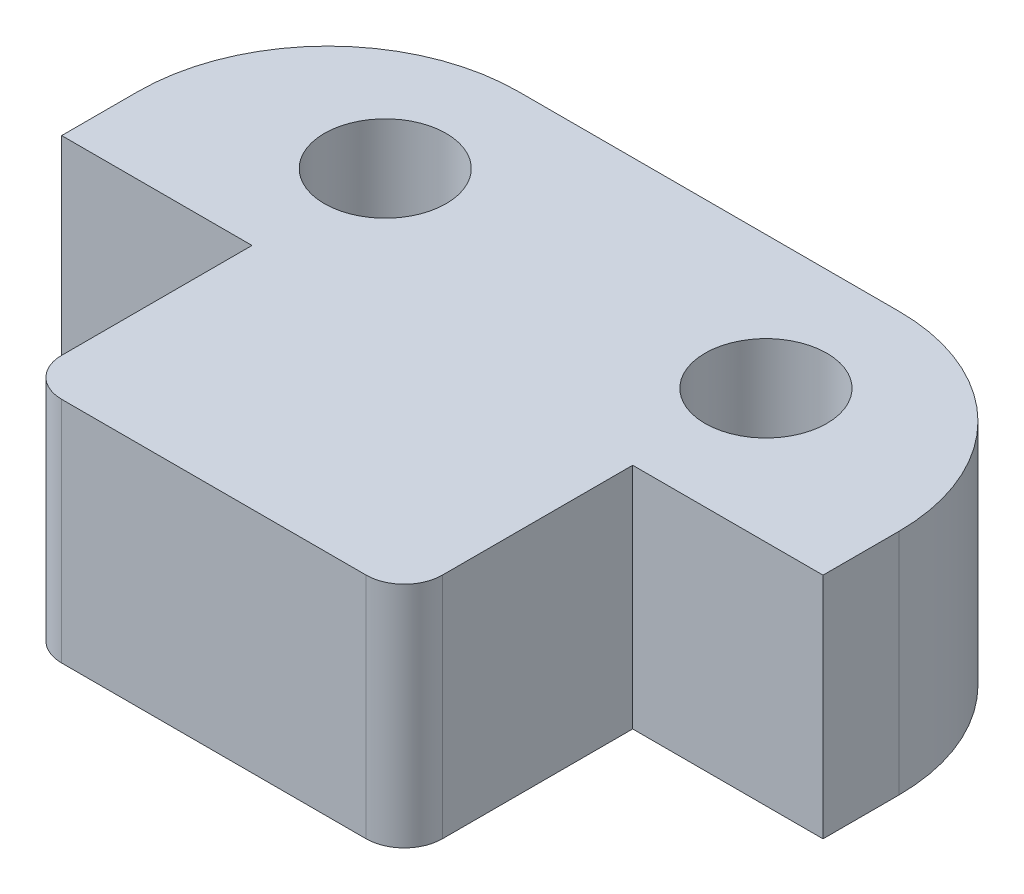
ISO-10303-21;
HEADER;
FILE_DESCRIPTION(('STEP AP214'),'2;1');
FILE_NAME('part.step','',(''),(''),'','','');
FILE_SCHEMA(('AUTOMOTIVE_DESIGN { 1 0 10303 214 1 1 1 1 }'));
ENDSEC;
DATA;
#1=APPLICATION_CONTEXT('core data for automotive mechanical design processes');
#2=APPLICATION_PROTOCOL_DEFINITION('international standard','automotive_design',2000,#1);
#3=PRODUCT_CONTEXT('',#1,'mechanical');
#4=PRODUCT('Part','Part','',(#3));
#5=PRODUCT_RELATED_PRODUCT_CATEGORY('part','',(#4));
#6=PRODUCT_DEFINITION_FORMATION('','',#4);
#7=PRODUCT_DEFINITION_CONTEXT('part definition',#1,'design');
#8=PRODUCT_DEFINITION('design','',#6,#7);
#9=PRODUCT_DEFINITION_SHAPE('','',#8);
#10=(LENGTH_UNIT() NAMED_UNIT(*) SI_UNIT(.MILLI.,.METRE.));
#11=(NAMED_UNIT(*) PLANE_ANGLE_UNIT() SI_UNIT($,.RADIAN.));
#12=(NAMED_UNIT(*) SI_UNIT($,.STERADIAN.) SOLID_ANGLE_UNIT());
#13=UNCERTAINTY_MEASURE_WITH_UNIT(LENGTH_MEASURE(1.E-05),#10,'distance_accuracy_value','');
#14=(GEOMETRIC_REPRESENTATION_CONTEXT(3) GLOBAL_UNCERTAINTY_ASSIGNED_CONTEXT((#13)) GLOBAL_UNIT_ASSIGNED_CONTEXT((#10,
#11,#12)) REPRESENTATION_CONTEXT('',''));
#15=CARTESIAN_POINT('',(0.,0.,0.));
#16=DIRECTION('',(0.,0.,1.));
#17=DIRECTION('',(1.,0.,0.));
#18=AXIS2_PLACEMENT_3D('',#15,#16,#17);
#19=CARTESIAN_POINT('',(-10.,6.,3.5));
#20=DIRECTION('',(0.,0.,-1.));
#21=DIRECTION('',(-1.,0.,0.));
#22=AXIS2_PLACEMENT_3D('',#19,#20,#21);
#23=PLANE('',#22);
#24=DIRECTION('',(0.,1.,0.));
#25=VECTOR('',#24,1.);
#26=CARTESIAN_POINT('',(5.00000000000006,6.00000000000001,3.5));
#27=LINE('',#26,#25);
#28=CARTESIAN_POINT('',(5.00000000000006,0.,3.5));
#29=VERTEX_POINT('',#28);
#30=CARTESIAN_POINT('',(5.00000000000006,6.,3.5));
#31=VERTEX_POINT('',#30);
#32=EDGE_CURVE('E154',#29,#31,#27,.T.);
#33=ORIENTED_EDGE('',*,*,#32,.F.);
#34=DIRECTION('',(1.,0.,0.));
#35=VECTOR('',#34,1.);
#36=CARTESIAN_POINT('',(-10.,0.,3.5));
#37=LINE('',#36,#35);
#38=CARTESIAN_POINT('',(10.,0.,3.5));
#39=VERTEX_POINT('',#38);
#40=EDGE_CURVE('E149',#29,#39,#37,.T.);
#41=ORIENTED_EDGE('',*,*,#40,.T.);
#42=DIRECTION('',(0.,-1.,0.));
#43=VECTOR('',#42,1.);
#44=CARTESIAN_POINT('',(10.,6.,3.5));
#45=LINE('',#44,#43);
#46=CARTESIAN_POINT('',(10.,6.,3.5));
#47=VERTEX_POINT('',#46);
#48=EDGE_CURVE('E186',#47,#39,#45,.T.);
#49=ORIENTED_EDGE('',*,*,#48,.F.);
#50=DIRECTION('',(1.,0.,0.));
#51=VECTOR('',#50,1.);
#52=CARTESIAN_POINT('',(-10.,6.,3.5));
#53=LINE('',#52,#51);
#54=EDGE_CURVE('E165',#31,#47,#53,.T.);
#55=ORIENTED_EDGE('',*,*,#54,.F.);
#56=EDGE_LOOP('',(#33,#41,#49,#55));
#57=FACE_BOUND('',#56,.T.);
#58=ADVANCED_FACE('F33',(#57),#23,.F.);
#59=DIRECTION('',(0.,-1.,0.));
#60=VECTOR('',#59,1.);
#61=CARTESIAN_POINT('',(-4.99999999999994,6.00000000000001,3.5));
#62=LINE('',#61,#60);
#63=CARTESIAN_POINT('',(-4.99999999999994,6.,3.5));
#64=VERTEX_POINT('',#63);
#65=CARTESIAN_POINT('',(-4.99999999999994,0.,3.5));
#66=VERTEX_POINT('',#65);
#67=EDGE_CURVE('E144',#64,#66,#62,.T.);
#68=ORIENTED_EDGE('',*,*,#67,.F.);
#69=CARTESIAN_POINT('',(-10.,6.,3.5));
#70=VERTEX_POINT('',#69);
#71=EDGE_CURVE('E184',#70,#64,#53,.T.);
#72=ORIENTED_EDGE('',*,*,#71,.F.);
#73=DIRECTION('',(0.,-1.,0.));
#74=VECTOR('',#73,1.);
#75=CARTESIAN_POINT('',(-10.,6.,3.5));
#76=LINE('',#75,#74);
#77=CARTESIAN_POINT('',(-10.,0.,3.5));
#78=VERTEX_POINT('',#77);
#79=EDGE_CURVE('E147',#70,#78,#76,.T.);
#80=ORIENTED_EDGE('',*,*,#79,.T.);
#81=EDGE_CURVE('E130',#78,#66,#37,.T.);
#82=ORIENTED_EDGE('',*,*,#81,.T.);
#83=EDGE_LOOP('',(#68,#72,#80,#82));
#84=FACE_BOUND('',#83,.T.);
#85=ADVANCED_FACE('F142',(#84),#23,.F.);
#86=CARTESIAN_POINT('',(10.,6.,-3.5));
#87=DIRECTION('',(-1.,0.,0.));
#88=DIRECTION('',(0.,0.,1.));
#89=AXIS2_PLACEMENT_3D('',#86,#87,#88);
#90=PLANE('',#89);
#91=DIRECTION('',(0.,0.,-1.));
#92=VECTOR('',#91,1.);
#93=CARTESIAN_POINT('',(10.,0.,-3.5));
#94=LINE('',#93,#92);
#95=CARTESIAN_POINT('',(10.,0.,1.5));
#96=VERTEX_POINT('',#95);
#97=EDGE_CURVE('E181',#39,#96,#94,.T.);
#98=ORIENTED_EDGE('',*,*,#97,.T.);
#99=DIRECTION('',(0.,-1.,0.));
#100=VECTOR('',#99,1.);
#101=CARTESIAN_POINT('',(10.,6.,1.5));
#102=LINE('',#101,#100);
#103=CARTESIAN_POINT('',(10.,6.,1.5));
#104=VERTEX_POINT('',#103);
#105=EDGE_CURVE('E56',#96,#104,#102,.F.);
#106=ORIENTED_EDGE('',*,*,#105,.T.);
#107=DIRECTION('',(0.,0.,-1.));
#108=VECTOR('',#107,1.);
#109=CARTESIAN_POINT('',(10.,6.,-3.5));
#110=LINE('',#109,#108);
#111=EDGE_CURVE('E148',#47,#104,#110,.T.);
#112=ORIENTED_EDGE('',*,*,#111,.F.);
#113=ORIENTED_EDGE('',*,*,#48,.T.);
#114=EDGE_LOOP('',(#98,#106,#112,#113));
#115=FACE_BOUND('',#114,.T.);
#116=ADVANCED_FACE('F249',(#115),#90,.F.);
#117=CARTESIAN_POINT('',(-10.,6.,-3.5));
#118=DIRECTION('',(0.,0.,1.));
#119=DIRECTION('',(1.,0.,0.));
#120=AXIS2_PLACEMENT_3D('',#117,#118,#119);
#121=PLANE('',#120);
#122=DIRECTION('',(-1.,0.,0.));
#123=VECTOR('',#122,1.);
#124=CARTESIAN_POINT('',(-10.,6.,-3.5));
#125=LINE('',#124,#123);
#126=CARTESIAN_POINT('',(5.,6.,-3.5));
#127=VERTEX_POINT('',#126);
#128=CARTESIAN_POINT('',(-5.,6.,-3.5));
#129=VERTEX_POINT('',#128);
#130=EDGE_CURVE('E176',#127,#129,#125,.T.);
#131=ORIENTED_EDGE('',*,*,#130,.F.);
#132=DIRECTION('',(0.,-1.,0.));
#133=VECTOR('',#132,1.);
#134=CARTESIAN_POINT('',(5.,6.,-3.5));
#135=LINE('',#134,#133);
#136=CARTESIAN_POINT('',(5.,0.,-3.5));
#137=VERTEX_POINT('',#136);
#138=EDGE_CURVE('E228',#127,#137,#135,.T.);
#139=ORIENTED_EDGE('',*,*,#138,.T.);
#140=DIRECTION('',(-1.,0.,0.));
#141=VECTOR('',#140,1.);
#142=CARTESIAN_POINT('',(-10.,0.,-3.5));
#143=LINE('',#142,#141);
#144=CARTESIAN_POINT('',(-5.,0.,-3.5));
#145=VERTEX_POINT('',#144);
#146=EDGE_CURVE('E248',#137,#145,#143,.T.);
#147=ORIENTED_EDGE('',*,*,#146,.T.);
#148=DIRECTION('',(0.,-1.,0.));
#149=VECTOR('',#148,1.);
#150=CARTESIAN_POINT('',(-5.,6.,-3.5));
#151=LINE('',#150,#149);
#152=EDGE_CURVE('E226',#145,#129,#151,.F.);
#153=ORIENTED_EDGE('',*,*,#152,.T.);
#154=EDGE_LOOP('',(#131,#139,#147,#153));
#155=FACE_BOUND('',#154,.T.);
#156=ADVANCED_FACE('F242',(#155),#121,.F.);
#157=CARTESIAN_POINT('',(-10.,6.,-3.5));
#158=DIRECTION('',(1.,0.,0.));
#159=DIRECTION('',(0.,0.,-1.));
#160=AXIS2_PLACEMENT_3D('',#157,#158,#159);
#161=PLANE('',#160);
#162=DIRECTION('',(0.,0.,1.));
#163=VECTOR('',#162,1.);
#164=CARTESIAN_POINT('',(-10.,6.,-3.5));
#165=LINE('',#164,#163);
#166=CARTESIAN_POINT('',(-10.,6.,1.5));
#167=VERTEX_POINT('',#166);
#168=EDGE_CURVE('E178',#167,#70,#165,.T.);
#169=ORIENTED_EDGE('',*,*,#168,.F.);
#170=DIRECTION('',(0.,-1.,0.));
#171=VECTOR('',#170,1.);
#172=CARTESIAN_POINT('',(-10.,6.,1.5));
#173=LINE('',#172,#171);
#174=CARTESIAN_POINT('',(-10.,0.,1.5));
#175=VERTEX_POINT('',#174);
#176=EDGE_CURVE('E11',#167,#175,#173,.T.);
#177=ORIENTED_EDGE('',*,*,#176,.T.);
#178=DIRECTION('',(0.,0.,1.));
#179=VECTOR('',#178,1.);
#180=CARTESIAN_POINT('',(-10.,0.,-3.5));
#181=LINE('',#180,#179);
#182=EDGE_CURVE('E188',#175,#78,#181,.T.);
#183=ORIENTED_EDGE('',*,*,#182,.T.);
#184=ORIENTED_EDGE('',*,*,#79,.F.);
#185=EDGE_LOOP('',(#169,#177,#183,#184));
#186=FACE_BOUND('',#185,.T.);
#187=ADVANCED_FACE('F252',(#186),#161,.F.);
#188=CARTESIAN_POINT('',(0.,6.,0.));
#189=DIRECTION('',(0.,1.,0.));
#190=DIRECTION('',(0.,0.,1.));
#191=AXIS2_PLACEMENT_3D('',#188,#189,#190);
#192=PLANE('',#191);
#193=CARTESIAN_POINT('',(-5.,6.,0.));
#194=DIRECTION('',(0.,1.,0.));
#195=DIRECTION('',(0.,0.,1.));
#196=AXIS2_PLACEMENT_3D('',#193,#194,#195);
#197=CIRCLE('',#196,1.59999999999999);
#198=CARTESIAN_POINT('',(-5.,6.,1.59999999999999));
#199=VERTEX_POINT('',#198);
#200=EDGE_CURVE('E300',#199,#199,#197,.T.);
#201=ORIENTED_EDGE('',*,*,#200,.F.);
#202=EDGE_LOOP('',(#201));
#203=FACE_BOUND('',#202,.T.);
#204=CARTESIAN_POINT('',(5.,6.,0.));
#205=DIRECTION('',(0.,1.,0.));
#206=DIRECTION('',(0.,0.,1.));
#207=AXIS2_PLACEMENT_3D('',#204,#205,#206);
#208=CIRCLE('',#207,1.59999999999999);
#209=CARTESIAN_POINT('',(5.,6.,1.59999999999999));
#210=VERTEX_POINT('',#209);
#211=EDGE_CURVE('E160',#210,#210,#208,.T.);
#212=ORIENTED_EDGE('',*,*,#211,.F.);
#213=EDGE_LOOP('',(#212));
#214=FACE_BOUND('',#213,.T.);
#215=ORIENTED_EDGE('',*,*,#111,.T.);
#216=CARTESIAN_POINT('',(5.,6.,1.5));
#217=DIRECTION('',(0.,1.,0.));
#218=DIRECTION('',(0.,0.,1.));
#219=AXIS2_PLACEMENT_3D('',#216,#217,#218);
#220=CIRCLE('',#219,5.);
#221=EDGE_CURVE('E41',#104,#127,#220,.T.);
#222=ORIENTED_EDGE('',*,*,#221,.T.);
#223=ORIENTED_EDGE('',*,*,#130,.T.);
#224=CARTESIAN_POINT('',(-5.,6.,1.5));
#225=DIRECTION('',(0.,1.,0.));
#226=DIRECTION('',(0.,0.,1.));
#227=AXIS2_PLACEMENT_3D('',#224,#225,#226);
#228=CIRCLE('',#227,5.);
#229=EDGE_CURVE('E48',#129,#167,#228,.T.);
#230=ORIENTED_EDGE('',*,*,#229,.T.);
#231=ORIENTED_EDGE('',*,*,#168,.T.);
#232=ORIENTED_EDGE('',*,*,#71,.T.);
#233=DIRECTION('',(0.,0.,-1.));
#234=VECTOR('',#233,1.);
#235=CARTESIAN_POINT('',(-4.99999999999994,6.00000000000001,9.5));
#236=LINE('',#235,#234);
#237=CARTESIAN_POINT('',(-4.99999999999994,6.00000000000001,8.5));
#238=VERTEX_POINT('',#237);
#239=EDGE_CURVE('E136',#238,#64,#236,.T.);
#240=ORIENTED_EDGE('',*,*,#239,.F.);
#241=CARTESIAN_POINT('',(-3.99999999999994,6.,8.5));
#242=DIRECTION('',(0.,1.,0.));
#243=DIRECTION('',(0.,0.,1.));
#244=AXIS2_PLACEMENT_3D('',#241,#242,#243);
#245=CIRCLE('',#244,1.);
#246=CARTESIAN_POINT('',(-3.99999999999994,6.00000000000001,9.5));
#247=VERTEX_POINT('',#246);
#248=EDGE_CURVE('E222',#238,#247,#245,.T.);
#249=ORIENTED_EDGE('',*,*,#248,.T.);
#250=DIRECTION('',(-1.,0.,0.));
#251=VECTOR('',#250,1.);
#252=CARTESIAN_POINT('',(-4.99999999999994,6.00000000000001,9.5));
#253=LINE('',#252,#251);
#254=CARTESIAN_POINT('',(4.00000000000006,6.00000000000001,9.5));
#255=VERTEX_POINT('',#254);
#256=EDGE_CURVE('E153',#255,#247,#253,.T.);
#257=ORIENTED_EDGE('',*,*,#256,.F.);
#258=CARTESIAN_POINT('',(4.00000000000006,6.,8.5));
#259=DIRECTION('',(0.,1.,0.));
#260=DIRECTION('',(0.,0.,1.));
#261=AXIS2_PLACEMENT_3D('',#258,#259,#260);
#262=CIRCLE('',#261,1.);
#263=CARTESIAN_POINT('',(5.00000000000006,6.00000000000001,8.5));
#264=VERTEX_POINT('',#263);
#265=EDGE_CURVE('E220',#255,#264,#262,.T.);
#266=ORIENTED_EDGE('',*,*,#265,.T.);
#267=DIRECTION('',(0.,0.,-1.));
#268=VECTOR('',#267,1.);
#269=CARTESIAN_POINT('',(5.00000000000006,6.00000000000001,9.5));
#270=LINE('',#269,#268);
#271=EDGE_CURVE('E214',#264,#31,#270,.T.);
#272=ORIENTED_EDGE('',*,*,#271,.T.);
#273=ORIENTED_EDGE('',*,*,#54,.T.);
#274=EDGE_LOOP('',(#215,#222,#223,#230,#231,#232,#240,#249,#257,#266,#272,#273));
#275=FACE_BOUND('',#274,.T.);
#276=ADVANCED_FACE('F238',(#203,#214,#275),#192,.T.);
#277=CARTESIAN_POINT('',(0.,0.,0.));
#278=DIRECTION('',(0.,1.,0.));
#279=DIRECTION('',(0.,0.,1.));
#280=AXIS2_PLACEMENT_3D('',#277,#278,#279);
#281=PLANE('',#280);
#282=CARTESIAN_POINT('',(-5.,0.,0.));
#283=DIRECTION('',(0.,-1.,0.));
#284=DIRECTION('',(0.,0.,-1.));
#285=AXIS2_PLACEMENT_3D('',#282,#283,#284);
#286=CIRCLE('',#285,1.59999999999999);
#287=CARTESIAN_POINT('',(-5.,0.,-1.59999999999999));
#288=VERTEX_POINT('',#287);
#289=EDGE_CURVE('E303',#288,#288,#286,.T.);
#290=ORIENTED_EDGE('',*,*,#289,.F.);
#291=EDGE_LOOP('',(#290));
#292=FACE_BOUND('',#291,.T.);
#293=CARTESIAN_POINT('',(5.,0.,0.));
#294=DIRECTION('',(0.,-1.,0.));
#295=DIRECTION('',(0.,0.,-1.));
#296=AXIS2_PLACEMENT_3D('',#293,#294,#295);
#297=CIRCLE('',#296,1.59999999999999);
#298=CARTESIAN_POINT('',(5.,0.,-1.59999999999999));
#299=VERTEX_POINT('',#298);
#300=EDGE_CURVE('E297',#299,#299,#297,.T.);
#301=ORIENTED_EDGE('',*,*,#300,.F.);
#302=EDGE_LOOP('',(#301));
#303=FACE_BOUND('',#302,.T.);
#304=ORIENTED_EDGE('',*,*,#146,.F.);
#305=CARTESIAN_POINT('',(5.,0.,1.5));
#306=DIRECTION('',(0.,1.,0.));
#307=DIRECTION('',(0.,0.,1.));
#308=AXIS2_PLACEMENT_3D('',#305,#306,#307);
#309=CIRCLE('',#308,5.);
#310=EDGE_CURVE('E233',#137,#96,#309,.F.);
#311=ORIENTED_EDGE('',*,*,#310,.T.);
#312=ORIENTED_EDGE('',*,*,#97,.F.);
#313=ORIENTED_EDGE('',*,*,#40,.F.);
#314=DIRECTION('',(0.,0.,-1.));
#315=VECTOR('',#314,1.);
#316=CARTESIAN_POINT('',(5.00000000000006,0.,9.5));
#317=LINE('',#316,#315);
#318=CARTESIAN_POINT('',(5.00000000000006,0.,8.5));
#319=VERTEX_POINT('',#318);
#320=EDGE_CURVE('E137',#319,#29,#317,.T.);
#321=ORIENTED_EDGE('',*,*,#320,.F.);
#322=CARTESIAN_POINT('',(4.00000000000006,0.,8.5));
#323=DIRECTION('',(0.,1.,0.));
#324=DIRECTION('',(0.,0.,1.));
#325=AXIS2_PLACEMENT_3D('',#322,#323,#324);
#326=CIRCLE('',#325,1.);
#327=CARTESIAN_POINT('',(4.00000000000006,0.,9.5));
#328=VERTEX_POINT('',#327);
#329=EDGE_CURVE('E204',#319,#328,#326,.F.);
#330=ORIENTED_EDGE('',*,*,#329,.T.);
#331=DIRECTION('',(1.,0.,0.));
#332=VECTOR('',#331,1.);
#333=CARTESIAN_POINT('',(-4.99999999999994,0.,9.5));
#334=LINE('',#333,#332);
#335=CARTESIAN_POINT('',(-3.99999999999994,0.,9.5));
#336=VERTEX_POINT('',#335);
#337=EDGE_CURVE('E157',#336,#328,#334,.T.);
#338=ORIENTED_EDGE('',*,*,#337,.F.);
#339=CARTESIAN_POINT('',(-3.99999999999994,0.,8.5));
#340=DIRECTION('',(0.,1.,0.));
#341=DIRECTION('',(0.,0.,1.));
#342=AXIS2_PLACEMENT_3D('',#339,#340,#341);
#343=CIRCLE('',#342,1.);
#344=CARTESIAN_POINT('',(-4.99999999999994,0.,8.5));
#345=VERTEX_POINT('',#344);
#346=EDGE_CURVE('E132',#336,#345,#343,.F.);
#347=ORIENTED_EDGE('',*,*,#346,.T.);
#348=DIRECTION('',(0.,0.,-1.));
#349=VECTOR('',#348,1.);
#350=CARTESIAN_POINT('',(-4.99999999999994,0.,9.5));
#351=LINE('',#350,#349);
#352=EDGE_CURVE('E125',#345,#66,#351,.T.);
#353=ORIENTED_EDGE('',*,*,#352,.T.);
#354=ORIENTED_EDGE('',*,*,#81,.F.);
#355=ORIENTED_EDGE('',*,*,#182,.F.);
#356=CARTESIAN_POINT('',(-5.,0.,1.5));
#357=DIRECTION('',(0.,1.,0.));
#358=DIRECTION('',(0.,0.,1.));
#359=AXIS2_PLACEMENT_3D('',#356,#357,#358);
#360=CIRCLE('',#359,5.);
#361=EDGE_CURVE('E231',#175,#145,#360,.F.);
#362=ORIENTED_EDGE('',*,*,#361,.T.);
#363=EDGE_LOOP('',(#304,#311,#312,#313,#321,#330,#338,#347,#353,#354,#355,#362));
#364=FACE_BOUND('',#363,.T.);
#365=ADVANCED_FACE('F128',(#292,#303,#364),#281,.F.);
#366=CARTESIAN_POINT('',(5.00000000000006,6.00000000000001,9.5));
#367=DIRECTION('',(-1.,0.,0.));
#368=DIRECTION('',(0.,-1.,0.));
#369=AXIS2_PLACEMENT_3D('',#366,#367,#368);
#370=PLANE('',#369);
#371=ORIENTED_EDGE('',*,*,#271,.F.);
#372=DIRECTION('',(0.,1.,0.));
#373=VECTOR('',#372,1.);
#374=CARTESIAN_POINT('',(5.00000000000006,0.,8.5));
#375=LINE('',#374,#373);
#376=EDGE_CURVE('E224',#264,#319,#375,.F.);
#377=ORIENTED_EDGE('',*,*,#376,.T.);
#378=ORIENTED_EDGE('',*,*,#320,.T.);
#379=ORIENTED_EDGE('',*,*,#32,.T.);
#380=EDGE_LOOP('',(#371,#377,#378,#379));
#381=FACE_BOUND('',#380,.T.);
#382=ADVANCED_FACE('F310',(#381),#370,.F.);
#383=CARTESIAN_POINT('',(-4.99999999999994,6.00000000000001,9.5));
#384=DIRECTION('',(1.,0.,0.));
#385=DIRECTION('',(0.,1.,0.));
#386=AXIS2_PLACEMENT_3D('',#383,#384,#385);
#387=PLANE('',#386);
#388=ORIENTED_EDGE('',*,*,#352,.F.);
#389=DIRECTION('',(0.,-1.,0.));
#390=VECTOR('',#389,1.);
#391=CARTESIAN_POINT('',(-4.99999999999994,6.00000000000001,8.5));
#392=LINE('',#391,#390);
#393=EDGE_CURVE('E212',#345,#238,#392,.F.);
#394=ORIENTED_EDGE('',*,*,#393,.T.);
#395=ORIENTED_EDGE('',*,*,#239,.T.);
#396=ORIENTED_EDGE('',*,*,#67,.T.);
#397=EDGE_LOOP('',(#388,#394,#395,#396));
#398=FACE_BOUND('',#397,.T.);
#399=ADVANCED_FACE('F151',(#398),#387,.F.);
#400=CARTESIAN_POINT('',(0.,0.,9.5));
#401=DIRECTION('',(0.,0.,1.));
#402=DIRECTION('',(1.,0.,0.));
#403=AXIS2_PLACEMENT_3D('',#400,#401,#402);
#404=PLANE('',#403);
#405=ORIENTED_EDGE('',*,*,#256,.T.);
#406=DIRECTION('',(0.,-1.,0.));
#407=VECTOR('',#406,1.);
#408=CARTESIAN_POINT('',(-3.99999999999994,0.,9.5));
#409=LINE('',#408,#407);
#410=EDGE_CURVE('E197',#247,#336,#409,.T.);
#411=ORIENTED_EDGE('',*,*,#410,.T.);
#412=ORIENTED_EDGE('',*,*,#337,.T.);
#413=DIRECTION('',(0.,1.,0.));
#414=VECTOR('',#413,1.);
#415=CARTESIAN_POINT('',(4.00000000000006,6.00000000000001,9.5));
#416=LINE('',#415,#414);
#417=EDGE_CURVE('E195',#328,#255,#416,.T.);
#418=ORIENTED_EDGE('',*,*,#417,.T.);
#419=EDGE_LOOP('',(#405,#411,#412,#418));
#420=FACE_BOUND('',#419,.T.);
#421=ADVANCED_FACE('F280',(#420),#404,.T.);
#422=CARTESIAN_POINT('',(-3.99999999999994,0.,8.5));
#423=DIRECTION('',(0.,1.,0.));
#424=DIRECTION('',(-1.,0.,0.));
#425=AXIS2_PLACEMENT_3D('',#422,#423,#424);
#426=CYLINDRICAL_SURFACE('',#425,1.);
#427=ORIENTED_EDGE('',*,*,#248,.F.);
#428=ORIENTED_EDGE('',*,*,#393,.F.);
#429=ORIENTED_EDGE('',*,*,#346,.F.);
#430=ORIENTED_EDGE('',*,*,#410,.F.);
#431=EDGE_LOOP('',(#427,#428,#429,#430));
#432=FACE_BOUND('',#431,.T.);
#433=ADVANCED_FACE('F276',(#432),#426,.T.);
#434=CARTESIAN_POINT('',(4.00000000000006,0.,8.5));
#435=DIRECTION('',(0.,-1.,0.));
#436=DIRECTION('',(1.,0.,0.));
#437=AXIS2_PLACEMENT_3D('',#434,#435,#436);
#438=CYLINDRICAL_SURFACE('',#437,1.);
#439=ORIENTED_EDGE('',*,*,#329,.F.);
#440=ORIENTED_EDGE('',*,*,#376,.F.);
#441=ORIENTED_EDGE('',*,*,#265,.F.);
#442=ORIENTED_EDGE('',*,*,#417,.F.);
#443=EDGE_LOOP('',(#439,#440,#441,#442));
#444=FACE_BOUND('',#443,.T.);
#445=ADVANCED_FACE('F279',(#444),#438,.T.);
#446=CARTESIAN_POINT('',(5.,0.,0.));
#447=DIRECTION('',(0.,-1.,0.));
#448=DIRECTION('',(0.,0.,-1.));
#449=AXIS2_PLACEMENT_3D('',#446,#447,#448);
#450=CYLINDRICAL_SURFACE('',#449,1.59999999999999);
#451=ORIENTED_EDGE('',*,*,#211,.T.);
#452=EDGE_LOOP('',(#451));
#453=FACE_BOUND('',#452,.T.);
#454=ORIENTED_EDGE('',*,*,#300,.T.);
#455=EDGE_LOOP('',(#454));
#456=FACE_BOUND('',#455,.T.);
#457=ADVANCED_FACE('F283',(#453,#456),#450,.F.);
#458=CARTESIAN_POINT('',(-5.,0.,0.));
#459=DIRECTION('',(0.,-1.,0.));
#460=DIRECTION('',(0.,0.,-1.));
#461=AXIS2_PLACEMENT_3D('',#458,#459,#460);
#462=CYLINDRICAL_SURFACE('',#461,1.59999999999999);
#463=ORIENTED_EDGE('',*,*,#200,.T.);
#464=EDGE_LOOP('',(#463));
#465=FACE_BOUND('',#464,.T.);
#466=ORIENTED_EDGE('',*,*,#289,.T.);
#467=EDGE_LOOP('',(#466));
#468=FACE_BOUND('',#467,.T.);
#469=ADVANCED_FACE('F259',(#465,#468),#462,.F.);
#470=CARTESIAN_POINT('',(5.,6.,1.5));
#471=DIRECTION('',(0.,-1.,0.));
#472=DIRECTION('',(0.,0.,-1.));
#473=AXIS2_PLACEMENT_3D('',#470,#471,#472);
#474=CYLINDRICAL_SURFACE('',#473,5.);
#475=ORIENTED_EDGE('',*,*,#221,.F.);
#476=ORIENTED_EDGE('',*,*,#105,.F.);
#477=ORIENTED_EDGE('',*,*,#310,.F.);
#478=ORIENTED_EDGE('',*,*,#138,.F.);
#479=EDGE_LOOP('',(#475,#476,#477,#478));
#480=FACE_BOUND('',#479,.T.);
#481=ADVANCED_FACE('F245',(#480),#474,.T.);
#482=CARTESIAN_POINT('',(-5.,6.,1.5));
#483=DIRECTION('',(0.,-1.,0.));
#484=DIRECTION('',(0.,0.,-1.));
#485=AXIS2_PLACEMENT_3D('',#482,#483,#484);
#486=CYLINDRICAL_SURFACE('',#485,5.);
#487=ORIENTED_EDGE('',*,*,#229,.F.);
#488=ORIENTED_EDGE('',*,*,#152,.F.);
#489=ORIENTED_EDGE('',*,*,#361,.F.);
#490=ORIENTED_EDGE('',*,*,#176,.F.);
#491=EDGE_LOOP('',(#487,#488,#489,#490));
#492=FACE_BOUND('',#491,.T.);
#493=ADVANCED_FACE('F35',(#492),#486,.T.);
#494=CLOSED_SHELL('',(#58,#85,#116,#156,#187,#276,#365,#382,#399,#421,#433,#445,#457,#469,#481,#493));
#495=MANIFOLD_SOLID_BREP('B2',#494);
#496=ADVANCED_BREP_SHAPE_REPRESENTATION('',(#18,#495),#14);
#497=SHAPE_DEFINITION_REPRESENTATION(#9,#496);
ENDSEC;
END-ISO-10303-21;
